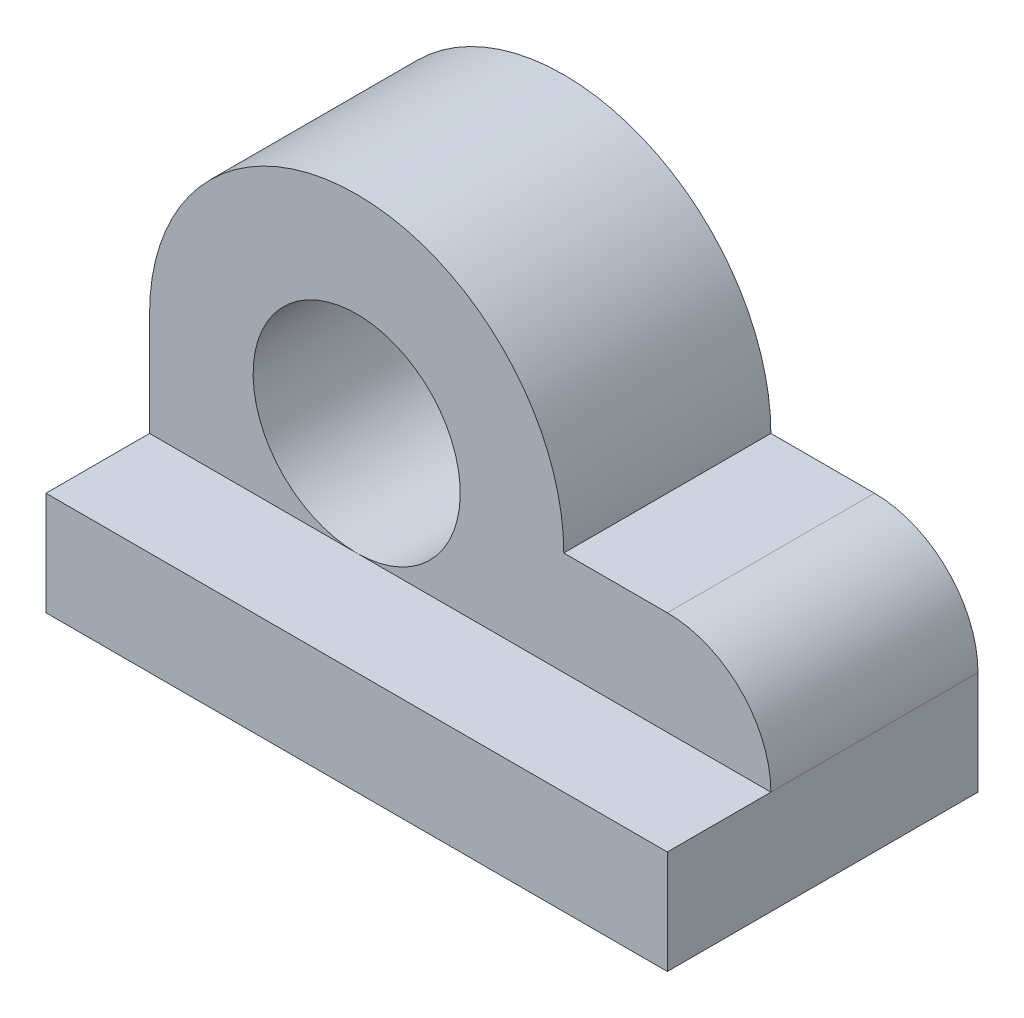
ISO-10303-21;
HEADER;
FILE_DESCRIPTION(('STEP AP214'),'2;1');
FILE_NAME('part.step','',(''),(''),'','','');
FILE_SCHEMA(('AUTOMOTIVE_DESIGN { 1 0 10303 214 1 1 1 1 }'));
ENDSEC;
DATA;
#1=APPLICATION_CONTEXT('core data for automotive mechanical design processes');
#2=APPLICATION_PROTOCOL_DEFINITION('international standard','automotive_design',2000,#1);
#3=PRODUCT_CONTEXT('',#1,'mechanical');
#4=PRODUCT('Part','Part','',(#3));
#5=PRODUCT_RELATED_PRODUCT_CATEGORY('part','',(#4));
#6=PRODUCT_DEFINITION_FORMATION('','',#4);
#7=PRODUCT_DEFINITION_CONTEXT('part definition',#1,'design');
#8=PRODUCT_DEFINITION('design','',#6,#7);
#9=PRODUCT_DEFINITION_SHAPE('','',#8);
#10=(LENGTH_UNIT() NAMED_UNIT(*) SI_UNIT(.MILLI.,.METRE.));
#11=(NAMED_UNIT(*) PLANE_ANGLE_UNIT() SI_UNIT($,.RADIAN.));
#12=(NAMED_UNIT(*) SI_UNIT($,.STERADIAN.) SOLID_ANGLE_UNIT());
#13=UNCERTAINTY_MEASURE_WITH_UNIT(LENGTH_MEASURE(1.E-05),#10,'distance_accuracy_value','');
#14=(GEOMETRIC_REPRESENTATION_CONTEXT(3) GLOBAL_UNCERTAINTY_ASSIGNED_CONTEXT((#13)) GLOBAL_UNIT_ASSIGNED_CONTEXT((#10,
#11,#12)) REPRESENTATION_CONTEXT('',''));
#15=CARTESIAN_POINT('',(0.,0.,0.));
#16=DIRECTION('',(0.,0.,1.));
#17=DIRECTION('',(1.,0.,0.));
#18=AXIS2_PLACEMENT_3D('',#15,#16,#17);
#19=CARTESIAN_POINT('',(4.,0.,2.));
#20=DIRECTION('',(-1.,0.,0.));
#21=DIRECTION('',(0.,0.,1.));
#22=AXIS2_PLACEMENT_3D('',#19,#20,#21);
#23=PLANE('',#22);
#24=DIRECTION('',(0.,1.,0.));
#25=VECTOR('',#24,1.);
#26=CARTESIAN_POINT('',(4.,0.,0.));
#27=LINE('',#26,#25);
#28=CARTESIAN_POINT('',(4.,-2.,0.));
#29=VERTEX_POINT('',#28);
#30=CARTESIAN_POINT('',(4.,-1.,0.));
#31=VERTEX_POINT('',#30);
#32=EDGE_CURVE('E142',#29,#31,#27,.T.);
#33=ORIENTED_EDGE('',*,*,#32,.T.);
#34=DIRECTION('',(0.,0.,-1.));
#35=VECTOR('',#34,1.);
#36=CARTESIAN_POINT('',(4.,-1.,2.));
#37=LINE('',#36,#35);
#38=CARTESIAN_POINT('',(4.,-1.,2.));
#39=VERTEX_POINT('',#38);
#40=EDGE_CURVE('E11',#39,#31,#37,.T.);
#41=ORIENTED_EDGE('',*,*,#40,.F.);
#42=DIRECTION('',(0.,0.,-1.));
#43=VECTOR('',#42,1.);
#44=CARTESIAN_POINT('',(4.,-1.,3.));
#45=LINE('',#44,#43);
#46=CARTESIAN_POINT('',(4.,-1.,3.));
#47=VERTEX_POINT('',#46);
#48=EDGE_CURVE('E108',#47,#39,#45,.T.);
#49=ORIENTED_EDGE('',*,*,#48,.F.);
#50=DIRECTION('',(0.,1.,0.));
#51=VECTOR('',#50,1.);
#52=CARTESIAN_POINT('',(4.,0.,3.));
#53=LINE('',#52,#51);
#54=CARTESIAN_POINT('',(4.,-2.,3.));
#55=VERTEX_POINT('',#54);
#56=EDGE_CURVE('E122',#55,#47,#53,.T.);
#57=ORIENTED_EDGE('',*,*,#56,.F.);
#58=DIRECTION('',(0.,0.,-1.));
#59=VECTOR('',#58,1.);
#60=CARTESIAN_POINT('',(4.,-2.,2.));
#61=LINE('',#60,#59);
#62=EDGE_CURVE('E141',#55,#29,#61,.T.);
#63=ORIENTED_EDGE('',*,*,#62,.T.);
#64=EDGE_LOOP('',(#33,#41,#49,#57,#63));
#65=FACE_BOUND('',#64,.T.);
#66=ADVANCED_FACE('F37',(#65),#23,.F.);
#67=CARTESIAN_POINT('',(3.,-1.,2.));
#68=DIRECTION('',(0.,0.,-1.));
#69=DIRECTION('',(-1.,0.,0.));
#70=AXIS2_PLACEMENT_3D('',#67,#68,#69);
#71=CYLINDRICAL_SURFACE('',#70,1.);
#72=CARTESIAN_POINT('',(3.,-1.,0.));
#73=DIRECTION('',(0.,0.,1.));
#74=DIRECTION('',(1.,0.,0.));
#75=AXIS2_PLACEMENT_3D('',#72,#73,#74);
#76=CIRCLE('',#75,1.);
#77=CARTESIAN_POINT('',(3.,0.,0.));
#78=VERTEX_POINT('',#77);
#79=EDGE_CURVE('E145',#31,#78,#76,.T.);
#80=ORIENTED_EDGE('',*,*,#79,.T.);
#81=DIRECTION('',(0.,0.,-1.));
#82=VECTOR('',#81,1.);
#83=CARTESIAN_POINT('',(3.,0.,2.));
#84=LINE('',#83,#82);
#85=CARTESIAN_POINT('',(3.,0.,2.));
#86=VERTEX_POINT('',#85);
#87=EDGE_CURVE('E44',#86,#78,#84,.T.);
#88=ORIENTED_EDGE('',*,*,#87,.F.);
#89=CARTESIAN_POINT('',(3.,-1.,2.));
#90=DIRECTION('',(0.,0.,1.));
#91=DIRECTION('',(1.,0.,0.));
#92=AXIS2_PLACEMENT_3D('',#89,#90,#91);
#93=CIRCLE('',#92,1.);
#94=EDGE_CURVE('E131',#39,#86,#93,.T.);
#95=ORIENTED_EDGE('',*,*,#94,.F.);
#96=ORIENTED_EDGE('',*,*,#40,.T.);
#97=EDGE_LOOP('',(#80,#88,#95,#96));
#98=FACE_BOUND('',#97,.T.);
#99=ADVANCED_FACE('F203',(#98),#71,.T.);
#100=CARTESIAN_POINT('',(0.,0.,2.));
#101=DIRECTION('',(0.,-1.,0.));
#102=DIRECTION('',(1.,0.,0.));
#103=AXIS2_PLACEMENT_3D('',#100,#101,#102);
#104=PLANE('',#103);
#105=DIRECTION('',(-1.,0.,0.));
#106=VECTOR('',#105,1.);
#107=CARTESIAN_POINT('',(0.,0.,0.));
#108=LINE('',#107,#106);
#109=CARTESIAN_POINT('',(2.,0.,0.));
#110=VERTEX_POINT('',#109);
#111=EDGE_CURVE('E147',#78,#110,#108,.T.);
#112=ORIENTED_EDGE('',*,*,#111,.T.);
#113=DIRECTION('',(0.,0.,-1.));
#114=VECTOR('',#113,1.);
#115=CARTESIAN_POINT('',(2.,0.,2.));
#116=LINE('',#115,#114);
#117=CARTESIAN_POINT('',(2.,0.,2.));
#118=VERTEX_POINT('',#117);
#119=EDGE_CURVE('E163',#118,#110,#116,.T.);
#120=ORIENTED_EDGE('',*,*,#119,.F.);
#121=DIRECTION('',(-1.,0.,0.));
#122=VECTOR('',#121,1.);
#123=CARTESIAN_POINT('',(0.,0.,2.));
#124=LINE('',#123,#122);
#125=EDGE_CURVE('E133',#86,#118,#124,.T.);
#126=ORIENTED_EDGE('',*,*,#125,.F.);
#127=ORIENTED_EDGE('',*,*,#87,.T.);
#128=EDGE_LOOP('',(#112,#120,#126,#127));
#129=FACE_BOUND('',#128,.T.);
#130=ADVANCED_FACE('F170',(#129),#104,.F.);
#131=CARTESIAN_POINT('',(0.,0.,2.));
#132=DIRECTION('',(0.,0.,-1.));
#133=DIRECTION('',(-1.,0.,0.));
#134=AXIS2_PLACEMENT_3D('',#131,#132,#133);
#135=CYLINDRICAL_SURFACE('',#134,2.);
#136=CARTESIAN_POINT('',(0.,0.,0.));
#137=DIRECTION('',(0.,0.,1.));
#138=DIRECTION('',(1.,0.,0.));
#139=AXIS2_PLACEMENT_3D('',#136,#137,#138);
#140=CIRCLE('',#139,2.);
#141=CARTESIAN_POINT('',(-2.,0.,0.));
#142=VERTEX_POINT('',#141);
#143=EDGE_CURVE('E149',#110,#142,#140,.T.);
#144=ORIENTED_EDGE('',*,*,#143,.T.);
#145=DIRECTION('',(0.,0.,-1.));
#146=VECTOR('',#145,1.);
#147=CARTESIAN_POINT('',(-2.,0.,2.));
#148=LINE('',#147,#146);
#149=CARTESIAN_POINT('',(-2.,0.,2.));
#150=VERTEX_POINT('',#149);
#151=EDGE_CURVE('E160',#150,#142,#148,.T.);
#152=ORIENTED_EDGE('',*,*,#151,.F.);
#153=CARTESIAN_POINT('',(0.,0.,2.));
#154=DIRECTION('',(0.,0.,1.));
#155=DIRECTION('',(1.,0.,0.));
#156=AXIS2_PLACEMENT_3D('',#153,#154,#155);
#157=CIRCLE('',#156,2.);
#158=EDGE_CURVE('E136',#118,#150,#157,.T.);
#159=ORIENTED_EDGE('',*,*,#158,.F.);
#160=ORIENTED_EDGE('',*,*,#119,.T.);
#161=EDGE_LOOP('',(#144,#152,#159,#160));
#162=FACE_BOUND('',#161,.T.);
#163=ADVANCED_FACE('F182',(#162),#135,.T.);
#164=CARTESIAN_POINT('',(-2.,0.,2.));
#165=DIRECTION('',(1.,0.,0.));
#166=DIRECTION('',(0.,1.,0.));
#167=AXIS2_PLACEMENT_3D('',#164,#165,#166);
#168=PLANE('',#167);
#169=DIRECTION('',(0.,-1.,0.));
#170=VECTOR('',#169,1.);
#171=CARTESIAN_POINT('',(-2.,0.,0.));
#172=LINE('',#171,#170);
#173=CARTESIAN_POINT('',(-2.,-2.,0.));
#174=VERTEX_POINT('',#173);
#175=EDGE_CURVE('E151',#142,#174,#172,.T.);
#176=ORIENTED_EDGE('',*,*,#175,.T.);
#177=DIRECTION('',(0.,0.,-1.));
#178=VECTOR('',#177,1.);
#179=CARTESIAN_POINT('',(-2.,-2.,2.));
#180=LINE('',#179,#178);
#181=CARTESIAN_POINT('',(-2.,-2.,3.));
#182=VERTEX_POINT('',#181);
#183=EDGE_CURVE('E114',#182,#174,#180,.T.);
#184=ORIENTED_EDGE('',*,*,#183,.F.);
#185=DIRECTION('',(0.,-1.,0.));
#186=VECTOR('',#185,1.);
#187=CARTESIAN_POINT('',(-2.,0.,3.));
#188=LINE('',#187,#186);
#189=CARTESIAN_POINT('',(-2.,-1.,3.));
#190=VERTEX_POINT('',#189);
#191=EDGE_CURVE('E111',#190,#182,#188,.T.);
#192=ORIENTED_EDGE('',*,*,#191,.F.);
#193=DIRECTION('',(0.,0.,-1.));
#194=VECTOR('',#193,1.);
#195=CARTESIAN_POINT('',(-2.,-1.,3.));
#196=LINE('',#195,#194);
#197=CARTESIAN_POINT('',(-2.,-1.,2.));
#198=VERTEX_POINT('',#197);
#199=EDGE_CURVE('E100',#190,#198,#196,.T.);
#200=ORIENTED_EDGE('',*,*,#199,.T.);
#201=DIRECTION('',(0.,-1.,0.));
#202=VECTOR('',#201,1.);
#203=CARTESIAN_POINT('',(-2.,0.,2.));
#204=LINE('',#203,#202);
#205=EDGE_CURVE('E56',#150,#198,#204,.T.);
#206=ORIENTED_EDGE('',*,*,#205,.F.);
#207=ORIENTED_EDGE('',*,*,#151,.T.);
#208=EDGE_LOOP('',(#176,#184,#192,#200,#206,#207));
#209=FACE_BOUND('',#208,.T.);
#210=ADVANCED_FACE('F112',(#209),#168,.F.);
#211=CARTESIAN_POINT('',(0.,-2.,2.));
#212=DIRECTION('',(0.,1.,0.));
#213=DIRECTION('',(0.,0.,1.));
#214=AXIS2_PLACEMENT_3D('',#211,#212,#213);
#215=PLANE('',#214);
#216=DIRECTION('',(1.,0.,0.));
#217=VECTOR('',#216,1.);
#218=CARTESIAN_POINT('',(0.,-2.,0.));
#219=LINE('',#218,#217);
#220=EDGE_CURVE('E153',#174,#29,#219,.T.);
#221=ORIENTED_EDGE('',*,*,#220,.T.);
#222=ORIENTED_EDGE('',*,*,#62,.F.);
#223=DIRECTION('',(1.,0.,0.));
#224=VECTOR('',#223,1.);
#225=CARTESIAN_POINT('',(0.,-2.,3.));
#226=LINE('',#225,#224);
#227=EDGE_CURVE('E118',#182,#55,#226,.T.);
#228=ORIENTED_EDGE('',*,*,#227,.F.);
#229=ORIENTED_EDGE('',*,*,#183,.T.);
#230=EDGE_LOOP('',(#221,#222,#228,#229));
#231=FACE_BOUND('',#230,.T.);
#232=ADVANCED_FACE('F185',(#231),#215,.F.);
#233=CARTESIAN_POINT('',(0.,0.,2.));
#234=DIRECTION('',(0.,0.,-1.));
#235=DIRECTION('',(-1.,0.,0.));
#236=AXIS2_PLACEMENT_3D('',#233,#234,#235);
#237=CYLINDRICAL_SURFACE('',#236,1.);
#238=CARTESIAN_POINT('',(0.,0.,0.));
#239=DIRECTION('',(0.,0.,1.));
#240=DIRECTION('',(1.,0.,0.));
#241=AXIS2_PLACEMENT_3D('',#238,#239,#240);
#242=CIRCLE('',#241,1.);
#243=CARTESIAN_POINT('',(1.,0.,0.));
#244=VERTEX_POINT('',#243);
#245=EDGE_CURVE('E134',#244,#244,#242,.T.);
#246=ORIENTED_EDGE('',*,*,#245,.F.);
#247=EDGE_LOOP('',(#246));
#248=FACE_BOUND('',#247,.T.);
#249=CARTESIAN_POINT('',(0.,0.,2.));
#250=DIRECTION('',(0.,0.,1.));
#251=DIRECTION('',(1.,0.,0.));
#252=AXIS2_PLACEMENT_3D('',#249,#250,#251);
#253=CIRCLE('',#252,1.);
#254=CARTESIAN_POINT('',(0.,-1.,2.));
#255=VERTEX_POINT('',#254);
#256=EDGE_CURVE('E139',#255,#255,#253,.T.);
#257=ORIENTED_EDGE('',*,*,#256,.T.);
#258=EDGE_LOOP('',(#257));
#259=FACE_BOUND('',#258,.T.);
#260=ADVANCED_FACE('F190',(#248,#259),#237,.F.);
#261=CARTESIAN_POINT('',(0.,0.,2.));
#262=DIRECTION('',(0.,0.,1.));
#263=DIRECTION('',(1.,0.,0.));
#264=AXIS2_PLACEMENT_3D('',#261,#262,#263);
#265=PLANE('',#264);
#266=DIRECTION('',(-1.,0.,0.));
#267=VECTOR('',#266,1.);
#268=CARTESIAN_POINT('',(0.,-1.,2.));
#269=LINE('',#268,#267);
#270=EDGE_CURVE('E130',#39,#255,#269,.T.);
#271=ORIENTED_EDGE('',*,*,#270,.F.);
#272=ORIENTED_EDGE('',*,*,#94,.T.);
#273=ORIENTED_EDGE('',*,*,#125,.T.);
#274=ORIENTED_EDGE('',*,*,#158,.T.);
#275=ORIENTED_EDGE('',*,*,#205,.T.);
#276=EDGE_CURVE('E51',#255,#198,#269,.T.);
#277=ORIENTED_EDGE('',*,*,#276,.F.);
#278=ORIENTED_EDGE('',*,*,#256,.F.);
#279=EDGE_LOOP('',(#271,#272,#273,#274,#275,#277,#278));
#280=FACE_BOUND('',#279,.T.);
#281=ADVANCED_FACE('F188',(#280),#265,.T.);
#282=CARTESIAN_POINT('',(0.,0.,0.));
#283=DIRECTION('',(0.,0.,1.));
#284=DIRECTION('',(1.,0.,0.));
#285=AXIS2_PLACEMENT_3D('',#282,#283,#284);
#286=PLANE('',#285);
#287=ORIENTED_EDGE('',*,*,#245,.T.);
#288=EDGE_LOOP('',(#287));
#289=FACE_BOUND('',#288,.T.);
#290=ORIENTED_EDGE('',*,*,#79,.F.);
#291=ORIENTED_EDGE('',*,*,#32,.F.);
#292=ORIENTED_EDGE('',*,*,#220,.F.);
#293=ORIENTED_EDGE('',*,*,#175,.F.);
#294=ORIENTED_EDGE('',*,*,#143,.F.);
#295=ORIENTED_EDGE('',*,*,#111,.F.);
#296=EDGE_LOOP('',(#290,#291,#292,#293,#294,#295));
#297=FACE_BOUND('',#296,.T.);
#298=ADVANCED_FACE('F176',(#289,#297),#286,.F.);
#299=CARTESIAN_POINT('',(0.,-1.,3.));
#300=DIRECTION('',(0.,1.,0.));
#301=DIRECTION('',(-1.,0.,0.));
#302=AXIS2_PLACEMENT_3D('',#299,#300,#301);
#303=PLANE('',#302);
#304=ORIENTED_EDGE('',*,*,#48,.T.);
#305=ORIENTED_EDGE('',*,*,#270,.T.);
#306=ORIENTED_EDGE('',*,*,#276,.T.);
#307=ORIENTED_EDGE('',*,*,#199,.F.);
#308=DIRECTION('',(1.,0.,0.));
#309=VECTOR('',#308,1.);
#310=CARTESIAN_POINT('',(0.,-1.,3.));
#311=LINE('',#310,#309);
#312=EDGE_CURVE('E105',#190,#47,#311,.T.);
#313=ORIENTED_EDGE('',*,*,#312,.T.);
#314=EDGE_LOOP('',(#304,#305,#306,#307,#313));
#315=FACE_BOUND('',#314,.T.);
#316=ADVANCED_FACE('F103',(#315),#303,.T.);
#317=CARTESIAN_POINT('',(0.,0.,3.));
#318=DIRECTION('',(0.,0.,1.));
#319=DIRECTION('',(1.,0.,0.));
#320=AXIS2_PLACEMENT_3D('',#317,#318,#319);
#321=PLANE('',#320);
#322=ORIENTED_EDGE('',*,*,#312,.F.);
#323=ORIENTED_EDGE('',*,*,#191,.T.);
#324=ORIENTED_EDGE('',*,*,#227,.T.);
#325=ORIENTED_EDGE('',*,*,#56,.T.);
#326=EDGE_LOOP('',(#322,#323,#324,#325));
#327=FACE_BOUND('',#326,.T.);
#328=ADVANCED_FACE('F120',(#327),#321,.T.);
#329=CLOSED_SHELL('',(#66,#99,#130,#163,#210,#232,#260,#281,#298,#316,#328));
#330=MANIFOLD_SOLID_BREP('B2',#329);
#331=ADVANCED_BREP_SHAPE_REPRESENTATION('',(#18,#330),#14);
#332=SHAPE_DEFINITION_REPRESENTATION(#9,#331);
ENDSEC;
END-ISO-10303-21;
